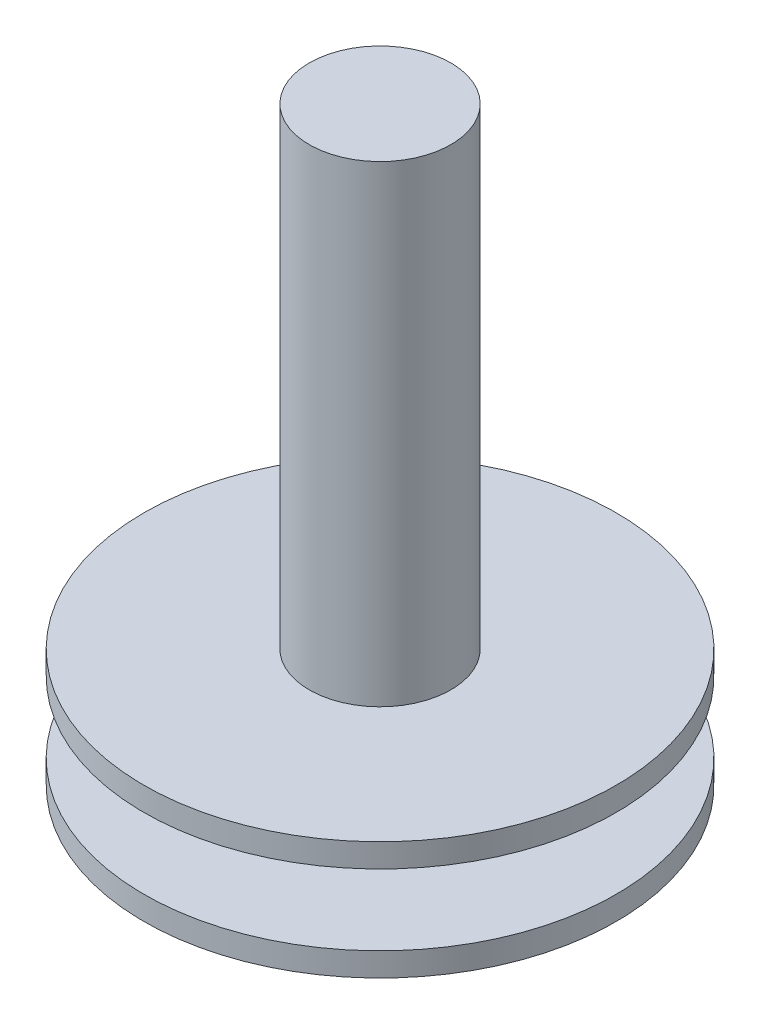
ISO-10303-21;
HEADER;
FILE_DESCRIPTION(('STEP AP214'),'2;1');
FILE_NAME('part.step','',(''),(''),'','','');
FILE_SCHEMA(('AUTOMOTIVE_DESIGN { 1 0 10303 214 1 1 1 1 }'));
ENDSEC;
DATA;
#1=APPLICATION_CONTEXT('core data for automotive mechanical design processes');
#2=APPLICATION_PROTOCOL_DEFINITION('international standard','automotive_design',2000,#1);
#3=PRODUCT_CONTEXT('',#1,'mechanical');
#4=PRODUCT('Part','Part','',(#3));
#5=PRODUCT_RELATED_PRODUCT_CATEGORY('part','',(#4));
#6=PRODUCT_DEFINITION_FORMATION('','',#4);
#7=PRODUCT_DEFINITION_CONTEXT('part definition',#1,'design');
#8=PRODUCT_DEFINITION('design','',#6,#7);
#9=PRODUCT_DEFINITION_SHAPE('','',#8);
#10=(LENGTH_UNIT() NAMED_UNIT(*) SI_UNIT(.MILLI.,.METRE.));
#11=(NAMED_UNIT(*) PLANE_ANGLE_UNIT() SI_UNIT($,.RADIAN.));
#12=(NAMED_UNIT(*) SI_UNIT($,.STERADIAN.) SOLID_ANGLE_UNIT());
#13=UNCERTAINTY_MEASURE_WITH_UNIT(LENGTH_MEASURE(1.E-05),#10,'distance_accuracy_value','');
#14=(GEOMETRIC_REPRESENTATION_CONTEXT(3) GLOBAL_UNCERTAINTY_ASSIGNED_CONTEXT((#13)) GLOBAL_UNIT_ASSIGNED_CONTEXT((#10,
#11,#12)) REPRESENTATION_CONTEXT('',''));
#15=CARTESIAN_POINT('',(0.,0.,0.));
#16=DIRECTION('',(0.,0.,1.));
#17=DIRECTION('',(1.,0.,0.));
#18=AXIS2_PLACEMENT_3D('',#15,#16,#17);
#19=CARTESIAN_POINT('',(0.,0.,0.));
#20=DIRECTION('',(0.,1.,0.));
#21=DIRECTION('',(-1.,0.,0.));
#22=AXIS2_PLACEMENT_3D('',#19,#20,#21);
#23=PLANE('',#22);
#24=CARTESIAN_POINT('',(0.,0.,0.));
#25=DIRECTION('',(0.,1.,0.));
#26=DIRECTION('',(-1.,0.,0.));
#27=AXIS2_PLACEMENT_3D('',#24,#25,#26);
#28=CIRCLE('',#27,10.);
#29=CARTESIAN_POINT('',(-10.,0.,0.));
#30=VERTEX_POINT('',#29);
#31=EDGE_CURVE('E40',#30,#30,#28,.T.);
#32=ORIENTED_EDGE('',*,*,#31,.F.);
#33=EDGE_LOOP('',(#32));
#34=FACE_BOUND('',#33,.T.);
#35=ADVANCED_FACE('F37',(#34),#23,.F.);
#36=CARTESIAN_POINT('',(0.,5.,0.));
#37=DIRECTION('',(0.,1.,0.));
#38=DIRECTION('',(-1.,0.,0.));
#39=AXIS2_PLACEMENT_3D('',#36,#37,#38);
#40=CYLINDRICAL_SURFACE('',#39,10.);
#41=CARTESIAN_POINT('',(0.,1.,0.));
#42=DIRECTION('',(0.,1.,0.));
#43=DIRECTION('',(-1.,0.,0.));
#44=AXIS2_PLACEMENT_3D('',#41,#42,#43);
#45=CIRCLE('',#44,10.);
#46=CARTESIAN_POINT('',(-10.,1.,0.));
#47=VERTEX_POINT('',#46);
#48=EDGE_CURVE('E48',#47,#47,#45,.T.);
#49=ORIENTED_EDGE('',*,*,#48,.F.);
#50=EDGE_LOOP('',(#49));
#51=FACE_BOUND('',#50,.T.);
#52=ORIENTED_EDGE('',*,*,#31,.T.);
#53=EDGE_LOOP('',(#52));
#54=FACE_BOUND('',#53,.T.);
#55=ADVANCED_FACE('F68',(#51,#54),#40,.T.);
#56=CARTESIAN_POINT('',(10.,1.,0.));
#57=DIRECTION('',(0.,-1.,0.));
#58=DIRECTION('',(1.,0.,0.));
#59=AXIS2_PLACEMENT_3D('',#56,#57,#58);
#60=PLANE('',#59);
#61=CARTESIAN_POINT('',(0.,0.999999999999999,0.));
#62=DIRECTION('',(0.,1.,0.));
#63=DIRECTION('',(-1.,0.,0.));
#64=AXIS2_PLACEMENT_3D('',#61,#62,#63);
#65=CIRCLE('',#64,5.);
#66=CARTESIAN_POINT('',(-5.,0.999999999999999,0.));
#67=VERTEX_POINT('',#66);
#68=EDGE_CURVE('E61',#67,#67,#65,.T.);
#69=ORIENTED_EDGE('',*,*,#68,.F.);
#70=EDGE_LOOP('',(#69));
#71=FACE_BOUND('',#70,.T.);
#72=ORIENTED_EDGE('',*,*,#48,.T.);
#73=EDGE_LOOP('',(#72));
#74=FACE_BOUND('',#73,.T.);
#75=ADVANCED_FACE('F66',(#71,#74),#60,.F.);
#76=CARTESIAN_POINT('',(0.,5.,0.));
#77=DIRECTION('',(0.,1.,0.));
#78=DIRECTION('',(-1.,0.,0.));
#79=AXIS2_PLACEMENT_3D('',#76,#77,#78);
#80=CYLINDRICAL_SURFACE('',#79,5.);
#81=CARTESIAN_POINT('',(0.,4.,0.));
#82=DIRECTION('',(0.,1.,0.));
#83=DIRECTION('',(-1.,0.,0.));
#84=AXIS2_PLACEMENT_3D('',#81,#82,#83);
#85=CIRCLE('',#84,5.);
#86=CARTESIAN_POINT('',(-5.,4.,0.));
#87=VERTEX_POINT('',#86);
#88=EDGE_CURVE('E58',#87,#87,#85,.T.);
#89=ORIENTED_EDGE('',*,*,#88,.F.);
#90=EDGE_LOOP('',(#89));
#91=FACE_BOUND('',#90,.T.);
#92=ORIENTED_EDGE('',*,*,#68,.T.);
#93=EDGE_LOOP('',(#92));
#94=FACE_BOUND('',#93,.T.);
#95=ADVANCED_FACE('F88',(#91,#94),#80,.T.);
#96=CARTESIAN_POINT('',(5.,4.,0.));
#97=DIRECTION('',(0.,1.,0.));
#98=DIRECTION('',(-1.,0.,0.));
#99=AXIS2_PLACEMENT_3D('',#96,#97,#98);
#100=PLANE('',#99);
#101=CARTESIAN_POINT('',(0.,4.,0.));
#102=DIRECTION('',(0.,1.,0.));
#103=DIRECTION('',(-1.,0.,0.));
#104=AXIS2_PLACEMENT_3D('',#101,#102,#103);
#105=CIRCLE('',#104,10.);
#106=CARTESIAN_POINT('',(-10.,4.,0.));
#107=VERTEX_POINT('',#106);
#108=EDGE_CURVE('E55',#107,#107,#105,.T.);
#109=ORIENTED_EDGE('',*,*,#108,.F.);
#110=EDGE_LOOP('',(#109));
#111=FACE_BOUND('',#110,.T.);
#112=ORIENTED_EDGE('',*,*,#88,.T.);
#113=EDGE_LOOP('',(#112));
#114=FACE_BOUND('',#113,.T.);
#115=ADVANCED_FACE('F97',(#111,#114),#100,.F.);
#116=CARTESIAN_POINT('',(0.,5.,0.));
#117=DIRECTION('',(0.,1.,0.));
#118=DIRECTION('',(-1.,0.,0.));
#119=AXIS2_PLACEMENT_3D('',#116,#117,#118);
#120=CYLINDRICAL_SURFACE('',#119,10.);
#121=CARTESIAN_POINT('',(0.,5.,0.));
#122=DIRECTION('',(0.,1.,0.));
#123=DIRECTION('',(-1.,0.,0.));
#124=AXIS2_PLACEMENT_3D('',#121,#122,#123);
#125=CIRCLE('',#124,10.);
#126=CARTESIAN_POINT('',(-10.,5.,0.));
#127=VERTEX_POINT('',#126);
#128=EDGE_CURVE('E52',#127,#127,#125,.T.);
#129=ORIENTED_EDGE('',*,*,#128,.F.);
#130=EDGE_LOOP('',(#129));
#131=FACE_BOUND('',#130,.T.);
#132=ORIENTED_EDGE('',*,*,#108,.T.);
#133=EDGE_LOOP('',(#132));
#134=FACE_BOUND('',#133,.T.);
#135=ADVANCED_FACE('F106',(#131,#134),#120,.T.);
#136=CARTESIAN_POINT('',(10.,5.,0.));
#137=DIRECTION('',(0.,-1.,0.));
#138=DIRECTION('',(1.,0.,0.));
#139=AXIS2_PLACEMENT_3D('',#136,#137,#138);
#140=PLANE('',#139);
#141=CARTESIAN_POINT('',(0.,5.,0.));
#142=DIRECTION('',(0.,1.,0.));
#143=DIRECTION('',(-1.,0.,0.));
#144=AXIS2_PLACEMENT_3D('',#141,#142,#143);
#145=CIRCLE('',#144,3.);
#146=CARTESIAN_POINT('',(-3.,5.,0.));
#147=VERTEX_POINT('',#146);
#148=EDGE_CURVE('E10',#147,#147,#145,.T.);
#149=ORIENTED_EDGE('',*,*,#148,.F.);
#150=EDGE_LOOP('',(#149));
#151=FACE_BOUND('',#150,.T.);
#152=ORIENTED_EDGE('',*,*,#128,.T.);
#153=EDGE_LOOP('',(#152));
#154=FACE_BOUND('',#153,.T.);
#155=ADVANCED_FACE('F115',(#151,#154),#140,.F.);
#156=CARTESIAN_POINT('',(0.,25.,0.));
#157=DIRECTION('',(0.,-1.,0.));
#158=DIRECTION('',(1.,0.,0.));
#159=AXIS2_PLACEMENT_3D('',#156,#157,#158);
#160=CYLINDRICAL_SURFACE('',#159,3.);
#161=CARTESIAN_POINT('',(0.,25.,0.));
#162=DIRECTION('',(0.,1.,0.));
#163=DIRECTION('',(-1.,0.,0.));
#164=AXIS2_PLACEMENT_3D('',#161,#162,#163);
#165=CIRCLE('',#164,3.);
#166=CARTESIAN_POINT('',(-3.,25.,0.));
#167=VERTEX_POINT('',#166);
#168=EDGE_CURVE('E51',#167,#167,#165,.T.);
#169=ORIENTED_EDGE('',*,*,#168,.F.);
#170=EDGE_LOOP('',(#169));
#171=FACE_BOUND('',#170,.T.);
#172=ORIENTED_EDGE('',*,*,#148,.T.);
#173=EDGE_LOOP('',(#172));
#174=FACE_BOUND('',#173,.T.);
#175=ADVANCED_FACE('F124',(#171,#174),#160,.T.);
#176=CARTESIAN_POINT('',(0.,25.,0.));
#177=DIRECTION('',(0.,1.,0.));
#178=DIRECTION('',(-1.,0.,0.));
#179=AXIS2_PLACEMENT_3D('',#176,#177,#178);
#180=PLANE('',#179);
#181=ORIENTED_EDGE('',*,*,#168,.T.);
#182=EDGE_LOOP('',(#181));
#183=FACE_BOUND('',#182,.T.);
#184=ADVANCED_FACE('F133',(#183),#180,.T.);
#185=CLOSED_SHELL('',(#35,#55,#75,#95,#115,#135,#155,#175,#184));
#186=MANIFOLD_SOLID_BREP('B2',#185);
#187=ADVANCED_BREP_SHAPE_REPRESENTATION('',(#18,#186),#14);
#188=SHAPE_DEFINITION_REPRESENTATION(#9,#187);
ENDSEC;
END-ISO-10303-21;
